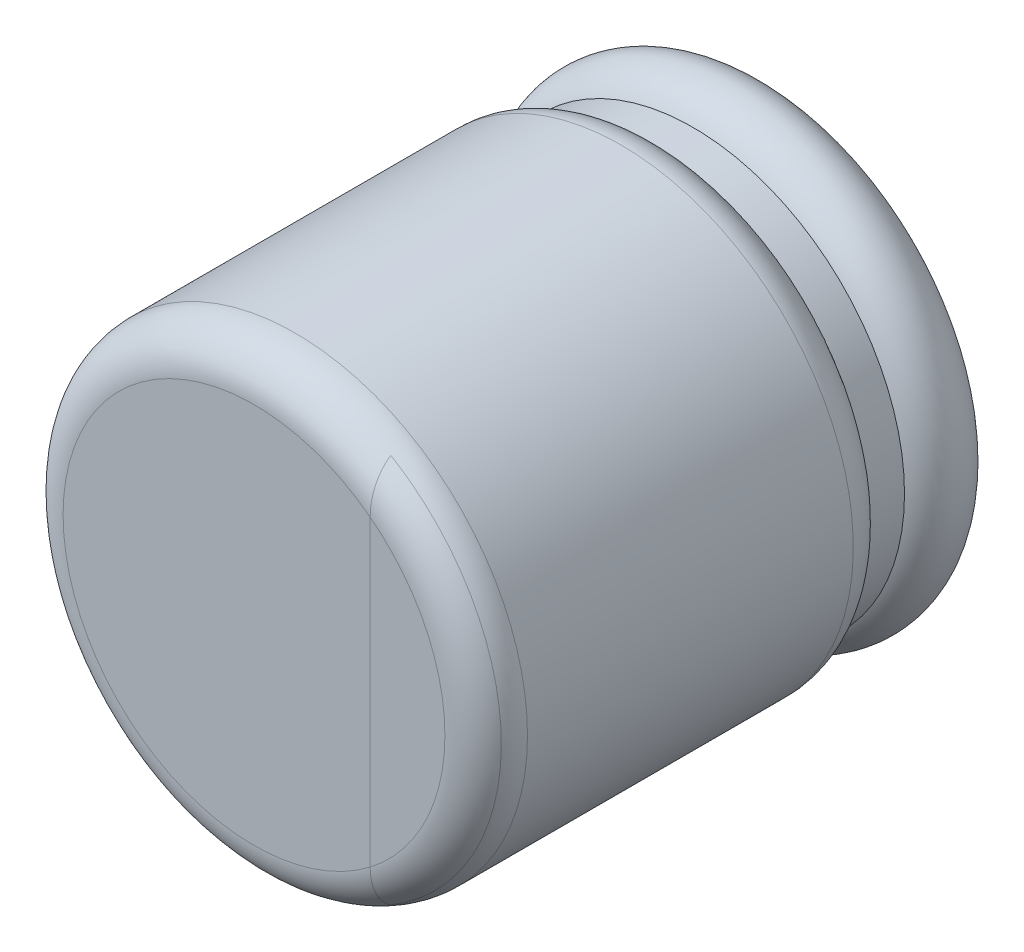
ISO-10303-21;
HEADER;
FILE_DESCRIPTION(('STEP AP214'),'2;1');
FILE_NAME('part.step','',(''),(''),'','','');
FILE_SCHEMA(('AUTOMOTIVE_DESIGN { 1 0 10303 214 1 1 1 1 }'));
ENDSEC;
DATA;
#1=APPLICATION_CONTEXT('core data for automotive mechanical design processes');
#2=APPLICATION_PROTOCOL_DEFINITION('international standard','automotive_design',2000,#1);
#3=PRODUCT_CONTEXT('',#1,'mechanical');
#4=PRODUCT('Part','Part','',(#3));
#5=PRODUCT_RELATED_PRODUCT_CATEGORY('part','',(#4));
#6=PRODUCT_DEFINITION_FORMATION('','',#4);
#7=PRODUCT_DEFINITION_CONTEXT('part definition',#1,'design');
#8=PRODUCT_DEFINITION('design','',#6,#7);
#9=PRODUCT_DEFINITION_SHAPE('','',#8);
#10=(LENGTH_UNIT() NAMED_UNIT(*) SI_UNIT(.MILLI.,.METRE.));
#11=(NAMED_UNIT(*) PLANE_ANGLE_UNIT() SI_UNIT($,.RADIAN.));
#12=(NAMED_UNIT(*) SI_UNIT($,.STERADIAN.) SOLID_ANGLE_UNIT());
#13=UNCERTAINTY_MEASURE_WITH_UNIT(LENGTH_MEASURE(1.E-05),#10,'distance_accuracy_value','');
#14=(GEOMETRIC_REPRESENTATION_CONTEXT(3) GLOBAL_UNCERTAINTY_ASSIGNED_CONTEXT((#13)) GLOBAL_UNIT_ASSIGNED_CONTEXT((#10,
#11,#12)) REPRESENTATION_CONTEXT('',''));
#15=CARTESIAN_POINT('',(0.,0.,0.));
#16=DIRECTION('',(0.,0.,1.));
#17=DIRECTION('',(1.,0.,0.));
#18=AXIS2_PLACEMENT_3D('',#15,#16,#17);
#19=CARTESIAN_POINT('',(1.8,0.,5.1));
#20=DIRECTION('',(0.,0.,-1.));
#21=DIRECTION('',(0.707106781186548,0.707106781186548,0.));
#22=AXIS2_PLACEMENT_3D('',#19,#20,#21);
#23=TOROIDAL_SURFACE('',#22,1.85,0.4);
#24=CARTESIAN_POINT('',(1.8,0.,5.3));
#25=DIRECTION('',(0.,0.,-1.));
#26=DIRECTION('',(0.512199415078578,0.858866554939219,0.));
#27=AXIS2_PLACEMENT_3D('',#24,#25,#26);
#28=CIRCLE('',#27,2.19641016151378);
#29=CARTESIAN_POINT('',(2.92499999999898,1.88642322865417,5.29999999999891));
#30=VERTEX_POINT('',#29);
#31=CARTESIAN_POINT('',(2.92499999999898,-1.88642322865417,5.29999999999891));
#32=VERTEX_POINT('',#31);
#33=EDGE_CURVE('E11',#30,#32,#28,.T.);
#34=ORIENTED_EDGE('',*,*,#33,.T.);
#35=CARTESIAN_POINT('',(2.925,-1.46863031427245,5.5));
#36=CARTESIAN_POINT('',(2.92500029234934,-1.47974458556802,5.50000010712895));
#37=CARTESIAN_POINT('',(2.92500445893071,-1.49085980523363,5.49970805038365));
#38=CARTESIAN_POINT('',(2.92501582142648,-1.51288313776722,5.49853392974207));
#39=CARTESIAN_POINT('',(2.92502296855376,-1.52379175341523,5.49766123878714));
#40=CARTESIAN_POINT('',(2.92503576582758,-1.54536733601008,5.49534011400917));
#41=CARTESIAN_POINT('',(2.9250414385633,-1.55603533559245,5.49390133841742));
#42=CARTESIAN_POINT('',(2.92504904648257,-1.57709534551719,5.49046474130828));
#43=CARTESIAN_POINT('',(2.92505104345315,-1.58748896735263,5.48847682018115));
#44=CARTESIAN_POINT('',(2.92505067228371,-1.60796731102166,5.48396064602866));
#45=CARTESIAN_POINT('',(2.92504838013648,-1.61805425278651,5.48144248813755));
#46=CARTESIAN_POINT('',(2.92504038001619,-1.63788735452031,5.47588661486455));
#47=CARTESIAN_POINT('',(2.9250347346268,-1.64763637801298,5.472859129544));
#48=CARTESIAN_POINT('',(2.92502239451748,-1.6667643531101,5.46630666195999));
#49=CARTESIAN_POINT('',(2.9250157212812,-1.67614681535501,5.46279198683365));
#50=CARTESIAN_POINT('',(2.92500748378925,-1.68998620054911,5.45713855669309));
#51=CARTESIAN_POINT('',(2.92500504478254,-1.69452819483544,5.4552058563499));
#52=CARTESIAN_POINT('',(2.92500149843393,-1.70350964264109,5.45122652279845));
#53=CARTESIAN_POINT('',(2.92500037843301,-1.70794966312583,5.44918117321271));
#54=CARTESIAN_POINT('',(2.9249993533056,-1.71686591478656,5.44491197237448));
#55=CARTESIAN_POINT('',(2.92499947602088,-1.72134072067881,5.44268514439123));
#56=CARTESIAN_POINT('',(2.92500007808363,-1.7301949081621,5.43810707054011));
#57=CARTESIAN_POINT('',(2.92500055545427,-1.73457468072169,5.43575658117727));
#58=CARTESIAN_POINT('',(2.92500187313423,-1.74323470475881,5.43093327519117));
#59=CARTESIAN_POINT('',(2.92500271142468,-1.74751537226441,5.4284612057974));
#60=CARTESIAN_POINT('',(2.9250045436389,-1.7559731745705,5.42339703505218));
#61=CARTESIAN_POINT('',(2.9250055366811,-1.76015074938438,5.42080566884884));
#62=CARTESIAN_POINT('',(2.92500756319851,-1.76839839721053,5.4155053287649));
#63=CARTESIAN_POINT('',(2.92500859642292,-1.77246893316323,5.41279707550374));
#64=CARTESIAN_POINT('',(2.92501059576497,-1.78049859609403,5.40726553273566));
#65=CARTESIAN_POINT('',(2.92501156221615,-1.78445820754153,5.40444294673567));
#66=CARTESIAN_POINT('',(2.92501334733705,-1.7922621790448,5.39868545005108));
#67=CARTESIAN_POINT('',(2.92501416677177,-1.79610704343898,5.39575122320227));
#68=CARTESIAN_POINT('',(2.92501559569773,-1.80367775031812,5.38977329593584));
#69=CARTESIAN_POINT('',(2.9250162062772,-1.80740411505459,5.38673025714098));
#70=CARTESIAN_POINT('',(2.9250171728136,-1.81473412989374,5.38053769409472));
#71=CARTESIAN_POINT('',(2.9250175300797,-1.81833831790843,5.37738880676795));
#72=CARTESIAN_POINT('',(2.92501795983043,-1.82542037049762,5.37098766952982));
#73=CARTESIAN_POINT('',(2.92501803375976,-1.82889878609001,5.36773602944695));
#74=CARTESIAN_POINT('',(2.92501787877673,-1.83572577484185,5.36113264154805));
#75=CARTESIAN_POINT('',(2.92501765137361,-1.83907490926956,5.35778147419036));
#76=CARTESIAN_POINT('',(2.92501688523544,-1.84563991249806,5.35098241640355));
#77=CARTESIAN_POINT('',(2.92501634801821,-1.84885634966514,5.34753507494577));
#78=CARTESIAN_POINT('',(2.92501496089815,-1.85515263618152,5.34054717813305));
#79=CARTESIAN_POINT('',(2.92501411248015,-1.85823305755946,5.33700713835533));
#80=CARTESIAN_POINT('',(2.92501210629989,-1.8642540988143,5.32983748387245));
#81=CARTESIAN_POINT('',(2.92501094996173,-1.86719529066761,5.32620834964175));
#82=CARTESIAN_POINT('',(2.92500833380098,-1.87293476606002,5.31886424011655));
#83=CARTESIAN_POINT('',(2.92500687532578,-1.87573361759219,5.31514970890309));
#84=CARTESIAN_POINT('',(2.92500366043577,-1.88118544397529,5.30763874725752));
#85=CARTESIAN_POINT('',(2.92500190528902,-1.88383897857194,5.30384272303709));
#86=CARTESIAN_POINT('',(2.92499999999795,-1.88642322865462,5.29999999999916));
#87=B_SPLINE_CURVE_WITH_KNOTS('',3,(#35,#36,#37,#38,#39,#40,#41,#42,#43,#44,#45,#46,#47,#48,#49,
#50,#51,#52,#53,#54,#55,#56,#57,#58,#59,#60,#61,#62,#63,#64,#65,#66,#67,#68,#69,#70,#71,#72,#73,
#74,#75,#76,#77,#78,#79,#80,#81,#82,#83,#84,#85,#86),.UNSPECIFIED.,.F.,.F.,(4,2,2,2,2,2,2,2,2,2,
2,2,2,2,2,2,2,2,2,2,2,2,2,2,2,4),(0.,0.0333403503145961,0.0661551516423671,0.0984328040208363,
0.130162755559885,0.161335845161482,0.1919446458447,0.22198380653124,0.236790333785384,
0.251453567732316,0.266446030136035,0.281355546429188,0.296182725726862,0.310928336178512,
0.325593311435137,0.34017875664827,0.354685953941322,0.369116367291986,0.383471646763102,
0.397753632018652,0.411964355061604,0.426106042131187,0.440181114698988,0.454192189506197,
0.46814207758838,0.482033782239477),.UNSPECIFIED.);
#88=CARTESIAN_POINT('',(2.925,-1.46863031427245,5.5));
#89=VERTEX_POINT('',#88);
#90=EDGE_CURVE('E75',#89,#32,#87,.T.);
#91=ORIENTED_EDGE('',*,*,#90,.F.);
#92=CARTESIAN_POINT('',(1.8,0.,5.5));
#93=DIRECTION('',(0.,0.,-1.));
#94=DIRECTION('',(0.608108108108109,-0.793854223931054,0.));
#95=AXIS2_PLACEMENT_3D('',#92,#93,#94);
#96=CIRCLE('',#95,1.85);
#97=CARTESIAN_POINT('',(2.925,1.46863031427245,5.5));
#98=VERTEX_POINT('',#97);
#99=EDGE_CURVE('E28',#89,#98,#96,.T.);
#100=ORIENTED_EDGE('',*,*,#99,.T.);
#101=CARTESIAN_POINT('',(2.925,1.46863031427245,5.5));
#102=CARTESIAN_POINT('',(2.92500029234934,1.47974458556754,5.50000010712895));
#103=CARTESIAN_POINT('',(2.92500445893072,1.49085980523267,5.49970805038368));
#104=CARTESIAN_POINT('',(2.92501582142653,1.51288313776544,5.49853392974219));
#105=CARTESIAN_POINT('',(2.92502296855383,1.52379175341311,5.49766123878732));
#106=CARTESIAN_POINT('',(2.9250357658277,1.54536733600741,5.49534011400949));
#107=CARTESIAN_POINT('',(2.92504143856345,1.55603533558958,5.49390133841781));
#108=CARTESIAN_POINT('',(2.92504904648278,1.57709534551406,5.49046474130882));
#109=CARTESIAN_POINT('',(2.92505104345339,1.58748896734943,5.48847682018176));
#110=CARTESIAN_POINT('',(2.925050672284,1.60796731101848,5.48396064602937));
#111=CARTESIAN_POINT('',(2.92504838013679,1.6180542527834,5.4814424881383));
#112=CARTESIAN_POINT('',(2.92504038001653,1.63788735451749,5.47588661486533));
#113=CARTESIAN_POINT('',(2.92503473462713,1.64763637801037,5.47285912954477));
#114=CARTESIAN_POINT('',(2.92502239451779,1.66676435310804,5.46630666196067));
#115=CARTESIAN_POINT('',(2.92501572128148,1.67614681535329,5.46279198683425));
#116=CARTESIAN_POINT('',(2.92500748378945,1.68998620054794,5.45713855669352));
#117=CARTESIAN_POINT('',(2.9250050447827,1.69452819483449,5.45520585635027));
#118=CARTESIAN_POINT('',(2.92500149843402,1.7035096426406,5.45122652279865));
#119=CARTESIAN_POINT('',(2.92500037843305,1.70794966312558,5.44918117321282));
#120=CARTESIAN_POINT('',(2.92499935330555,1.71686591478637,5.44491197237458));
#121=CARTESIAN_POINT('',(2.92499947602078,1.72134072067845,5.44268514439145));
#122=CARTESIAN_POINT('',(2.92500007808345,1.73019490816142,5.43810707054053));
#123=CARTESIAN_POINT('',(2.92500055545405,1.73457468072087,5.43575658117779));
#124=CARTESIAN_POINT('',(2.92500187313396,1.74323470475772,5.43093327519188));
#125=CARTESIAN_POINT('',(2.92500271142439,1.74751537226321,5.42846120579821));
#126=CARTESIAN_POINT('',(2.92500454363856,1.75597317456909,5.42339703505318));
#127=CARTESIAN_POINT('',(2.92500553668075,1.76015074938287,5.42080566884993));
#128=CARTESIAN_POINT('',(2.92500756319814,1.76839839720887,5.41550532876615));
#129=CARTESIAN_POINT('',(2.92500859642254,1.77246893316151,5.41279707550506));
#130=CARTESIAN_POINT('',(2.92501059576458,1.7804985960922,5.40726553273712));
#131=CARTESIAN_POINT('',(2.92501156221576,1.78445820753966,5.40444294673719));
#132=CARTESIAN_POINT('',(2.92501334733667,1.79226217904288,5.39868545005271));
#133=CARTESIAN_POINT('',(2.9250141667714,1.79610704343703,5.39575122320394));
#134=CARTESIAN_POINT('',(2.92501559569738,1.80367775031616,5.3897732959376));
#135=CARTESIAN_POINT('',(2.92501620627686,1.80740411505264,5.38673025714277));
#136=CARTESIAN_POINT('',(2.92501717281329,1.81473412989182,5.38053769409654));
#137=CARTESIAN_POINT('',(2.92501753007941,1.81833831790654,5.37738880676978));
#138=CARTESIAN_POINT('',(2.92501795983017,1.8254203704958,5.37098766953165));
#139=CARTESIAN_POINT('',(2.92501803375951,1.82889878608824,5.36773602944877));
#140=CARTESIAN_POINT('',(2.92501787877652,1.83572577484019,5.36113264154982));
#141=CARTESIAN_POINT('',(2.92501765137341,1.83907490926796,5.3577814741921));
#142=CARTESIAN_POINT('',(2.92501688523528,1.8456399124966,5.35098241640519));
#143=CARTESIAN_POINT('',(2.92501634801808,1.84885634966376,5.34753507494736));
#144=CARTESIAN_POINT('',(2.92501496089805,1.85515263618031,5.34054717813449));
#145=CARTESIAN_POINT('',(2.92501411248006,1.85823305755834,5.33700713835669));
#146=CARTESIAN_POINT('',(2.92501210629983,1.86425409881338,5.32983748387361));
#147=CARTESIAN_POINT('',(2.92501094996168,1.8671952906668,5.3262083496428));
#148=CARTESIAN_POINT('',(2.92500833380096,1.87293476605943,5.31886424011734));
#149=CARTESIAN_POINT('',(2.92500687532577,1.87573361759171,5.31514970890374));
#150=CARTESIAN_POINT('',(2.92500366043577,1.88118544397505,5.30763874725787));
#151=CARTESIAN_POINT('',(2.92500190528902,1.88383897857182,5.30384272303726));
#152=CARTESIAN_POINT('',(2.92499999999796,1.88642322865462,5.29999999999916));
#153=B_SPLINE_CURVE_WITH_KNOTS('',3,(#101,#102,#103,#104,#105,#106,#107,#108,#109,#110,#111,
#112,#113,#114,#115,#116,#117,#118,#119,#120,#121,#122,#123,#124,#125,#126,#127,#128,#129,#130,
#131,#132,#133,#134,#135,#136,#137,#138,#139,#140,#141,#142,#143,#144,#145,#146,#147,#148,#149,
#150,#151,#152),.UNSPECIFIED.,.F.,.F.,(4,2,2,2,2,2,2,2,2,2,2,2,2,2,2,2,2,2,2,2,2,2,2,2,2,4),(0.,
0.0333403503131608,0.066155151639895,0.098432804017731,0.130162755556559,0.161335845158351,
0.191944645842184,0.221983806529762,0.236790333784582,0.251453567732295,0.266446030135408,
0.281355546428032,0.296182725725258,0.310928336176537,0.325593311432873,0.3401787566458,
0.354685953938727,0.369116367289348,0.383471646760504,0.397753632016177,0.411964355059336,
0.42610604212921,0.440181114697386,0.454192189505055,0.468142077587782,0.482033782239507),.UNSPECIFIED.);
#154=EDGE_CURVE('E74',#98,#30,#153,.T.);
#155=ORIENTED_EDGE('',*,*,#154,.T.);
#156=EDGE_LOOP('',(#34,#91,#100,#155));
#157=FACE_BOUND('',#156,.T.);
#158=CARTESIAN_POINT('',(1.8,0.,5.1));
#159=DIRECTION('',(0.,0.,-1.));
#160=DIRECTION('',(-1.,0.,0.));
#161=AXIS2_PLACEMENT_3D('',#158,#159,#160);
#162=CIRCLE('',#161,2.25);
#163=CARTESIAN_POINT('',(-0.45,0.,5.1));
#164=VERTEX_POINT('',#163);
#165=EDGE_CURVE('E85',#164,#164,#162,.T.);
#166=ORIENTED_EDGE('',*,*,#165,.F.);
#167=EDGE_LOOP('',(#166));
#168=FACE_BOUND('',#167,.T.);
#169=ADVANCED_FACE('F16',(#157,#168),#23,.T.);
#170=CARTESIAN_POINT('',(1.8,0.,5.1));
#171=DIRECTION('',(0.,0.,-1.));
#172=DIRECTION('',(0.707106781186548,0.707106781186548,0.));
#173=AXIS2_PLACEMENT_3D('',#170,#171,#172);
#174=TOROIDAL_SURFACE('',#173,1.85,0.4);
#175=ORIENTED_EDGE('',*,*,#33,.F.);
#176=ORIENTED_EDGE('',*,*,#154,.F.);
#177=CARTESIAN_POINT('',(1.8,0.,5.5));
#178=DIRECTION('',(0.,0.,-1.));
#179=DIRECTION('',(0.608108108108108,0.793854223931055,0.));
#180=AXIS2_PLACEMENT_3D('',#177,#178,#179);
#181=CIRCLE('',#180,1.85);
#182=EDGE_CURVE('E71',#98,#89,#181,.T.);
#183=ORIENTED_EDGE('',*,*,#182,.T.);
#184=ORIENTED_EDGE('',*,*,#90,.T.);
#185=EDGE_LOOP('',(#175,#176,#183,#184));
#186=FACE_BOUND('',#185,.T.);
#187=ADVANCED_FACE('F94',(#186),#174,.T.);
#188=CARTESIAN_POINT('',(1.8,0.,5.5));
#189=DIRECTION('',(0.,0.,1.));
#190=DIRECTION('',(0.707106781186548,0.707106781186548,0.));
#191=AXIS2_PLACEMENT_3D('',#188,#189,#190);
#192=PLANE('',#191);
#193=DIRECTION('',(0.,-1.,0.));
#194=VECTOR('',#193,1.);
#195=CARTESIAN_POINT('',(2.925,1.46863031427245,5.5));
#196=LINE('',#195,#194);
#197=EDGE_CURVE('E82',#98,#89,#196,.T.);
#198=ORIENTED_EDGE('',*,*,#197,.T.);
#199=ORIENTED_EDGE('',*,*,#182,.F.);
#200=EDGE_LOOP('',(#198,#199));
#201=FACE_BOUND('',#200,.T.);
#202=ADVANCED_FACE('F104',(#201),#192,.T.);
#203=CARTESIAN_POINT('',(1.8,0.,5.5));
#204=DIRECTION('',(0.,0.,1.));
#205=DIRECTION('',(0.707106781186548,0.707106781186548,0.));
#206=AXIS2_PLACEMENT_3D('',#203,#204,#205);
#207=PLANE('',#206);
#208=ORIENTED_EDGE('',*,*,#197,.F.);
#209=ORIENTED_EDGE('',*,*,#99,.F.);
#210=EDGE_LOOP('',(#208,#209));
#211=FACE_BOUND('',#210,.T.);
#212=ADVANCED_FACE('F109',(#211),#207,.T.);
#213=CARTESIAN_POINT('',(1.8,0.,5.1));
#214=DIRECTION('',(0.,0.,-1.));
#215=DIRECTION('',(-1.,0.,0.));
#216=AXIS2_PLACEMENT_3D('',#213,#214,#215);
#217=CYLINDRICAL_SURFACE('',#216,2.25);
#218=ORIENTED_EDGE('',*,*,#165,.T.);
#219=EDGE_LOOP('',(#218));
#220=FACE_BOUND('',#219,.T.);
#221=CARTESIAN_POINT('',(1.8,0.,1.94282032302755));
#222=DIRECTION('',(0.,0.,-1.));
#223=DIRECTION('',(-1.,0.,0.));
#224=AXIS2_PLACEMENT_3D('',#221,#222,#223);
#225=CIRCLE('',#224,2.25);
#226=CARTESIAN_POINT('',(-0.45,0.,1.94282032302755));
#227=VERTEX_POINT('',#226);
#228=EDGE_CURVE('E135',#227,#227,#225,.T.);
#229=ORIENTED_EDGE('',*,*,#228,.F.);
#230=EDGE_LOOP('',(#229));
#231=FACE_BOUND('',#230,.T.);
#232=ADVANCED_FACE('F113',(#220,#231),#217,.T.);
#233=CARTESIAN_POINT('',(1.8,0.,1.94282032302755));
#234=DIRECTION('',(0.,0.,-1.));
#235=DIRECTION('',(0.707106781186548,0.707106781186548,0.));
#236=AXIS2_PLACEMENT_3D('',#233,#234,#235);
#237=TOROIDAL_SURFACE('',#236,1.85,0.4);
#238=CARTESIAN_POINT('',(1.8,0.,1.59641016151378));
#239=DIRECTION('',(0.,0.,-1.));
#240=DIRECTION('',(-1.,0.,0.));
#241=AXIS2_PLACEMENT_3D('',#238,#239,#240);
#242=CIRCLE('',#241,2.05);
#243=CARTESIAN_POINT('',(-0.25,0.,1.59641016151378));
#244=VERTEX_POINT('',#243);
#245=EDGE_CURVE('E65',#244,#244,#242,.T.);
#246=ORIENTED_EDGE('',*,*,#245,.F.);
#247=EDGE_LOOP('',(#246));
#248=FACE_BOUND('',#247,.T.);
#249=ORIENTED_EDGE('',*,*,#228,.T.);
#250=EDGE_LOOP('',(#249));
#251=FACE_BOUND('',#250,.T.);
#252=ADVANCED_FACE('F117',(#248,#251),#237,.T.);
#253=CARTESIAN_POINT('',(1.8,0.,1.59641016151378));
#254=DIRECTION('',(0.,0.,-1.));
#255=DIRECTION('',(-1.,0.,0.));
#256=AXIS2_PLACEMENT_3D('',#253,#254,#255);
#257=CYLINDRICAL_SURFACE('',#256,2.05);
#258=ORIENTED_EDGE('',*,*,#245,.T.);
#259=EDGE_LOOP('',(#258));
#260=FACE_BOUND('',#259,.T.);
#261=CARTESIAN_POINT('',(1.8,0.,1.24641016151378));
#262=DIRECTION('',(0.,0.,-1.));
#263=DIRECTION('',(-1.,0.,0.));
#264=AXIS2_PLACEMENT_3D('',#261,#262,#263);
#265=CIRCLE('',#264,2.05);
#266=CARTESIAN_POINT('',(-0.25,0.,1.24641016151378));
#267=VERTEX_POINT('',#266);
#268=EDGE_CURVE('E56',#267,#267,#265,.T.);
#269=ORIENTED_EDGE('',*,*,#268,.F.);
#270=EDGE_LOOP('',(#269));
#271=FACE_BOUND('',#270,.T.);
#272=ADVANCED_FACE('F121',(#260,#271),#257,.T.);
#273=CARTESIAN_POINT('',(1.8,0.,0.9));
#274=DIRECTION('',(0.,0.,-1.));
#275=DIRECTION('',(0.707106781186548,0.707106781186548,0.));
#276=AXIS2_PLACEMENT_3D('',#273,#274,#275);
#277=TOROIDAL_SURFACE('',#276,1.85,0.4);
#278=CARTESIAN_POINT('',(1.8,0.,0.5));
#279=DIRECTION('',(0.,0.,-1.));
#280=DIRECTION('',(-1.,0.,0.));
#281=AXIS2_PLACEMENT_3D('',#278,#279,#280);
#282=CIRCLE('',#281,1.84999999995964);
#283=CARTESIAN_POINT('',(-0.05,0.,0.5));
#284=VERTEX_POINT('',#283);
#285=EDGE_CURVE('E60',#284,#284,#282,.T.);
#286=ORIENTED_EDGE('',*,*,#285,.F.);
#287=EDGE_LOOP('',(#286));
#288=FACE_BOUND('',#287,.T.);
#289=ORIENTED_EDGE('',*,*,#268,.T.);
#290=EDGE_LOOP('',(#289));
#291=FACE_BOUND('',#290,.T.);
#292=ADVANCED_FACE('F61',(#288,#291),#277,.T.);
#293=CARTESIAN_POINT('',(1.8,0.,0.5));
#294=DIRECTION('',(0.,0.,-1.));
#295=DIRECTION('',(0.707106781186548,0.707106781186548,0.));
#296=AXIS2_PLACEMENT_3D('',#293,#294,#295);
#297=PLANE('',#296);
#298=ORIENTED_EDGE('',*,*,#285,.T.);
#299=EDGE_LOOP('',(#298));
#300=FACE_BOUND('',#299,.T.);
#301=ADVANCED_FACE('F18',(#300),#297,.T.);
#302=CLOSED_SHELL('',(#169,#187,#202,#212,#232,#252,#272,#292,#301));
#303=MANIFOLD_SOLID_BREP('B1',#302);
#304=ADVANCED_BREP_SHAPE_REPRESENTATION('',(#18,#303),#14);
#305=SHAPE_DEFINITION_REPRESENTATION(#9,#304);
ENDSEC;
END-ISO-10303-21;
